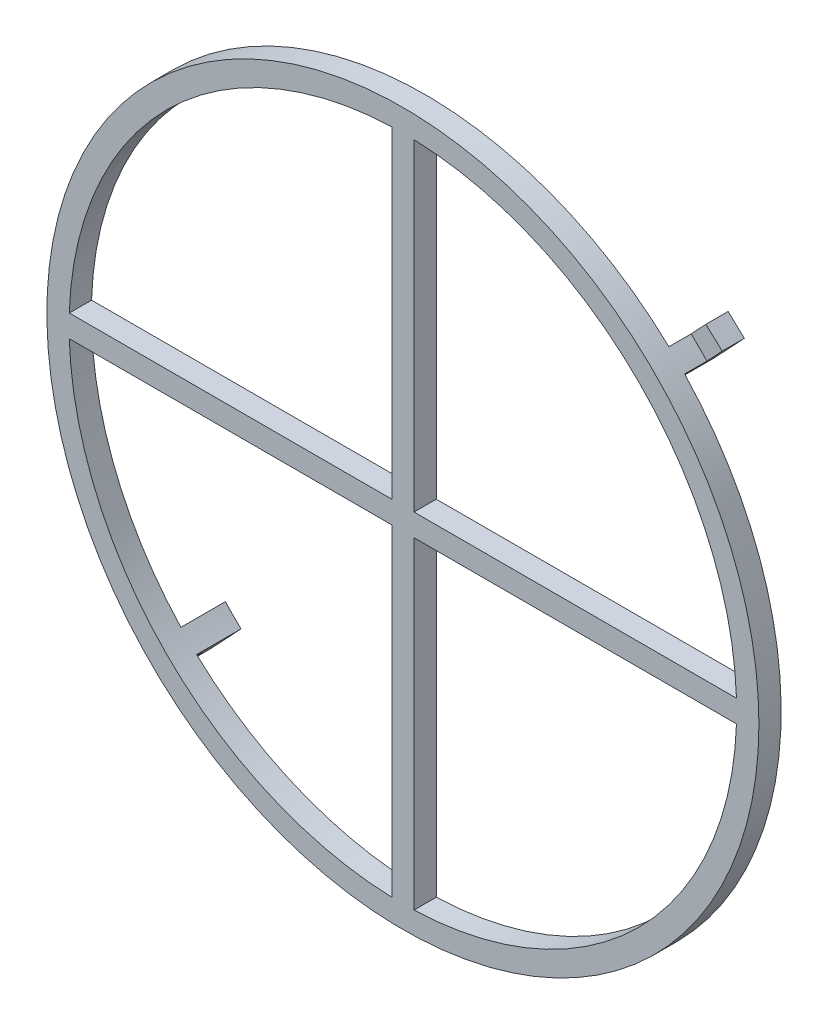
ISO-10303-21;
HEADER;
FILE_DESCRIPTION(('STEP AP214'),'2;1');
FILE_NAME('part.step','',(''),(''),'','','');
FILE_SCHEMA(('AUTOMOTIVE_DESIGN { 1 0 10303 214 1 1 1 1 }'));
ENDSEC;
DATA;
#1=APPLICATION_CONTEXT('core data for automotive mechanical design processes');
#2=APPLICATION_PROTOCOL_DEFINITION('international standard','automotive_design',2000,#1);
#3=PRODUCT_CONTEXT('',#1,'mechanical');
#4=PRODUCT('Part','Part','',(#3));
#5=PRODUCT_RELATED_PRODUCT_CATEGORY('part','',(#4));
#6=PRODUCT_DEFINITION_FORMATION('','',#4);
#7=PRODUCT_DEFINITION_CONTEXT('part definition',#1,'design');
#8=PRODUCT_DEFINITION('design','',#6,#7);
#9=PRODUCT_DEFINITION_SHAPE('','',#8);
#10=(LENGTH_UNIT() NAMED_UNIT(*) SI_UNIT(.MILLI.,.METRE.));
#11=(NAMED_UNIT(*) PLANE_ANGLE_UNIT() SI_UNIT($,.RADIAN.));
#12=(NAMED_UNIT(*) SI_UNIT($,.STERADIAN.) SOLID_ANGLE_UNIT());
#13=UNCERTAINTY_MEASURE_WITH_UNIT(LENGTH_MEASURE(1.E-05),#10,'distance_accuracy_value','');
#14=(GEOMETRIC_REPRESENTATION_CONTEXT(3) GLOBAL_UNCERTAINTY_ASSIGNED_CONTEXT((#13)) GLOBAL_UNIT_ASSIGNED_CONTEXT((#10,
#11,#12)) REPRESENTATION_CONTEXT('',''));
#15=CARTESIAN_POINT('',(0.,0.,0.));
#16=DIRECTION('',(0.,0.,1.));
#17=DIRECTION('',(1.,0.,0.));
#18=AXIS2_PLACEMENT_3D('',#15,#16,#17);
#19=CARTESIAN_POINT('',(0.,0.,0.));
#20=DIRECTION('',(0.,0.,1.));
#21=DIRECTION('',(1.,0.,0.));
#22=AXIS2_PLACEMENT_3D('',#19,#20,#21);
#23=PLANE('',#22);
#24=CARTESIAN_POINT('',(0.,0.,0.));
#25=DIRECTION('',(0.,0.,1.));
#26=DIRECTION('',(1.,0.,0.));
#27=AXIS2_PLACEMENT_3D('',#24,#25,#26);
#28=CIRCLE('',#27,15.);
#29=CARTESIAN_POINT('',(-0.499999999999996,14.9916643505649,0.));
#30=VERTEX_POINT('',#29);
#31=CARTESIAN_POINT('',(-14.9916643505649,0.499999999999996,0.));
#32=VERTEX_POINT('',#31);
#33=EDGE_CURVE('E365',#30,#32,#28,.T.);
#34=ORIENTED_EDGE('',*,*,#33,.T.);
#35=DIRECTION('',(1.,0.,0.));
#36=VECTOR('',#35,1.);
#37=CARTESIAN_POINT('',(-14.9916643505649,0.499999999999996,0.));
#38=LINE('',#37,#36);
#39=CARTESIAN_POINT('',(-0.499999999999997,0.499999999999997,0.));
#40=VERTEX_POINT('',#39);
#41=EDGE_CURVE('E377',#32,#40,#38,.T.);
#42=ORIENTED_EDGE('',*,*,#41,.T.);
#43=DIRECTION('',(0.,1.,0.));
#44=VECTOR('',#43,1.);
#45=CARTESIAN_POINT('',(-0.499999999999996,14.9916643505649,0.));
#46=LINE('',#45,#44);
#47=EDGE_CURVE('E369',#40,#30,#46,.T.);
#48=ORIENTED_EDGE('',*,*,#47,.T.);
#49=EDGE_LOOP('',(#34,#42,#48));
#50=FACE_BOUND('',#49,.T.);
#51=CARTESIAN_POINT('',(0.,0.,0.));
#52=DIRECTION('',(0.,0.,1.));
#53=DIRECTION('',(1.,0.,0.));
#54=AXIS2_PLACEMENT_3D('',#51,#52,#53);
#55=CIRCLE('',#54,15.);
#56=CARTESIAN_POINT('',(0.500000000000004,-14.9916643505649,0.));
#57=VERTEX_POINT('',#56);
#58=CARTESIAN_POINT('',(14.9916643505649,-0.500000000000003,0.));
#59=VERTEX_POINT('',#58);
#60=EDGE_CURVE('E293',#57,#59,#55,.T.);
#61=ORIENTED_EDGE('',*,*,#60,.T.);
#62=DIRECTION('',(-1.,0.,0.));
#63=VECTOR('',#62,1.);
#64=CARTESIAN_POINT('',(0.500000000000004,-0.500000000000004,0.));
#65=LINE('',#64,#63);
#66=CARTESIAN_POINT('',(0.500000000000004,-0.500000000000004,0.));
#67=VERTEX_POINT('',#66);
#68=EDGE_CURVE('E305',#59,#67,#65,.T.);
#69=ORIENTED_EDGE('',*,*,#68,.T.);
#70=DIRECTION('',(0.,-1.,0.));
#71=VECTOR('',#70,1.);
#72=CARTESIAN_POINT('',(0.500000000000004,-0.500000000000004,0.));
#73=LINE('',#72,#71);
#74=EDGE_CURVE('E297',#67,#57,#73,.T.);
#75=ORIENTED_EDGE('',*,*,#74,.T.);
#76=EDGE_LOOP('',(#61,#69,#75));
#77=FACE_BOUND('',#76,.T.);
#78=DIRECTION('',(0.684666621748958,0.728856376155735,0.));
#79=VECTOR('',#78,1.);
#80=CARTESIAN_POINT('',(-11.6617705183814,-10.9545930265168,0.));
#81=LINE('',#80,#79);
#82=CARTESIAN_POINT('',(-11.6617705183814,-10.9545930265168,0.));
#83=VERTEX_POINT('',#82);
#84=CARTESIAN_POINT('',(-10.9756744302996,-10.2242149234094,0.));
#85=VERTEX_POINT('',#84);
#86=EDGE_CURVE('E58',#83,#85,#81,.T.);
#87=ORIENTED_EDGE('',*,*,#86,.F.);
#88=CARTESIAN_POINT('',(0.,0.,0.));
#89=DIRECTION('',(0.,0.,1.));
#90=DIRECTION('',(1.,0.,0.));
#91=AXIS2_PLACEMENT_3D('',#88,#89,#90);
#92=CIRCLE('',#91,16.);
#93=CARTESIAN_POINT('',(10.9546659479833,11.6617020184918,0.));
#94=VERTEX_POINT('',#93);
#95=EDGE_CURVE('E40',#94,#83,#92,.T.);
#96=ORIENTED_EDGE('',*,*,#95,.F.);
#97=DIRECTION('',(0.684666621748957,0.728856376155735,0.));
#98=VECTOR('',#97,1.);
#99=CARTESIAN_POINT('',(10.9546659479833,11.6617020184918,0.));
#100=LINE('',#99,#98);
#101=CARTESIAN_POINT('',(10.2699993262344,10.932845642336,0.));
#102=VERTEX_POINT('',#101);
#103=EDGE_CURVE('E277',#102,#94,#100,.T.);
#104=ORIENTED_EDGE('',*,*,#103,.F.);
#105=CARTESIAN_POINT('',(0.,0.,0.));
#106=DIRECTION('',(0.,0.,1.));
#107=DIRECTION('',(1.,0.,0.));
#108=AXIS2_PLACEMENT_3D('',#105,#106,#107);
#109=CIRCLE('',#108,15.);
#110=CARTESIAN_POINT('',(0.500000000000004,14.9916643505649,0.));
#111=VERTEX_POINT('',#110);
#112=EDGE_CURVE('E317',#102,#111,#109,.T.);
#113=ORIENTED_EDGE('',*,*,#112,.T.);
#114=DIRECTION('',(0.,-1.,0.));
#115=VECTOR('',#114,1.);
#116=CARTESIAN_POINT('',(0.500000000000004,14.9916643505649,0.));
#117=LINE('',#116,#115);
#118=CARTESIAN_POINT('',(0.500000000000004,0.499999999999997,0.));
#119=VERTEX_POINT('',#118);
#120=EDGE_CURVE('E329',#111,#119,#117,.T.);
#121=ORIENTED_EDGE('',*,*,#120,.T.);
#122=DIRECTION('',(1.,0.,0.));
#123=VECTOR('',#122,1.);
#124=CARTESIAN_POINT('',(0.500000000000004,0.499999999999997,0.));
#125=LINE('',#124,#123);
#126=CARTESIAN_POINT('',(14.9916643505649,0.499999999999996,0.));
#127=VERTEX_POINT('',#126);
#128=EDGE_CURVE('E321',#119,#127,#125,.T.);
#129=ORIENTED_EDGE('',*,*,#128,.T.);
#130=CARTESIAN_POINT('',(10.9756744302996,10.2242149234094,0.));
#131=VERTEX_POINT('',#130);
#132=EDGE_CURVE('E327',#127,#131,#109,.T.);
#133=ORIENTED_EDGE('',*,*,#132,.T.);
#134=DIRECTION('',(-0.684666621748958,-0.728856376155735,0.));
#135=VECTOR('',#134,1.);
#136=CARTESIAN_POINT('',(11.6617705183814,10.9545930265168,0.));
#137=LINE('',#136,#135);
#138=CARTESIAN_POINT('',(11.6617705183814,10.9545930265168,0.));
#139=VERTEX_POINT('',#138);
#140=EDGE_CURVE('E272',#139,#131,#137,.T.);
#141=ORIENTED_EDGE('',*,*,#140,.F.);
#142=CARTESIAN_POINT('',(-10.9546659479833,-11.6617020184918,0.));
#143=VERTEX_POINT('',#142);
#144=EDGE_CURVE('E51',#143,#139,#92,.T.);
#145=ORIENTED_EDGE('',*,*,#144,.F.);
#146=DIRECTION('',(-0.684666621748957,-0.728856376155735,0.));
#147=VECTOR('',#146,1.);
#148=CARTESIAN_POINT('',(-10.9546659479833,-11.6617020184918,0.));
#149=LINE('',#148,#147);
#150=CARTESIAN_POINT('',(-10.2699993262344,-10.932845642336,0.));
#151=VERTEX_POINT('',#150);
#152=EDGE_CURVE('E241',#151,#143,#149,.T.);
#153=ORIENTED_EDGE('',*,*,#152,.F.);
#154=CARTESIAN_POINT('',(0.,0.,0.));
#155=DIRECTION('',(0.,0.,1.));
#156=DIRECTION('',(1.,0.,0.));
#157=AXIS2_PLACEMENT_3D('',#154,#155,#156);
#158=CIRCLE('',#157,15.);
#159=CARTESIAN_POINT('',(-0.499999999999996,-14.9916643505649,0.));
#160=VERTEX_POINT('',#159);
#161=EDGE_CURVE('E341',#151,#160,#158,.T.);
#162=ORIENTED_EDGE('',*,*,#161,.T.);
#163=DIRECTION('',(0.,1.,0.));
#164=VECTOR('',#163,1.);
#165=CARTESIAN_POINT('',(-0.499999999999997,-0.500000000000003,0.));
#166=LINE('',#165,#164);
#167=CARTESIAN_POINT('',(-0.499999999999997,-0.500000000000003,0.));
#168=VERTEX_POINT('',#167);
#169=EDGE_CURVE('E353',#160,#168,#166,.T.);
#170=ORIENTED_EDGE('',*,*,#169,.T.);
#171=DIRECTION('',(-1.,0.,0.));
#172=VECTOR('',#171,1.);
#173=CARTESIAN_POINT('',(-14.9916643505649,-0.500000000000003,0.));
#174=LINE('',#173,#172);
#175=CARTESIAN_POINT('',(-14.9916643505649,-0.500000000000003,0.));
#176=VERTEX_POINT('',#175);
#177=EDGE_CURVE('E345',#168,#176,#174,.T.);
#178=ORIENTED_EDGE('',*,*,#177,.T.);
#179=EDGE_CURVE('E351',#176,#85,#158,.T.);
#180=ORIENTED_EDGE('',*,*,#179,.T.);
#181=EDGE_LOOP('',(#87,#96,#104,#113,#121,#129,#133,#141,#145,#153,#162,#170,#178,#180));
#182=FACE_BOUND('',#181,.T.);
#183=ADVANCED_FACE('F36',(#50,#77,#182),#23,.F.);
#184=CARTESIAN_POINT('',(0.,0.,1.));
#185=DIRECTION('',(0.,0.,1.));
#186=DIRECTION('',(1.,0.,0.));
#187=AXIS2_PLACEMENT_3D('',#184,#185,#186);
#188=PLANE('',#187);
#189=CARTESIAN_POINT('',(0.,0.,1.));
#190=DIRECTION('',(0.,0.,1.));
#191=DIRECTION('',(1.,0.,0.));
#192=AXIS2_PLACEMENT_3D('',#189,#190,#191);
#193=CIRCLE('',#192,16.);
#194=CARTESIAN_POINT('',(16.,0.,1.));
#195=VERTEX_POINT('',#194);
#196=EDGE_CURVE('E11',#195,#195,#193,.T.);
#197=ORIENTED_EDGE('',*,*,#196,.T.);
#198=EDGE_LOOP('',(#197));
#199=FACE_BOUND('',#198,.T.);
#200=DIRECTION('',(1.,0.,0.));
#201=VECTOR('',#200,1.);
#202=CARTESIAN_POINT('',(-14.9916643505649,0.499999999999996,1.));
#203=LINE('',#202,#201);
#204=CARTESIAN_POINT('',(-14.9916643505649,0.499999999999996,1.));
#205=VERTEX_POINT('',#204);
#206=CARTESIAN_POINT('',(-0.499999999999997,0.499999999999997,1.));
#207=VERTEX_POINT('',#206);
#208=EDGE_CURVE('E368',#205,#207,#203,.T.);
#209=ORIENTED_EDGE('',*,*,#208,.F.);
#210=CARTESIAN_POINT('',(0.,0.,1.));
#211=DIRECTION('',(0.,0.,1.));
#212=DIRECTION('',(1.,0.,0.));
#213=AXIS2_PLACEMENT_3D('',#210,#211,#212);
#214=CIRCLE('',#213,15.);
#215=CARTESIAN_POINT('',(-0.499999999999996,14.9916643505649,1.));
#216=VERTEX_POINT('',#215);
#217=EDGE_CURVE('E366',#216,#205,#214,.T.);
#218=ORIENTED_EDGE('',*,*,#217,.F.);
#219=DIRECTION('',(0.,1.,0.));
#220=VECTOR('',#219,1.);
#221=CARTESIAN_POINT('',(-0.499999999999996,14.9916643505649,1.));
#222=LINE('',#221,#220);
#223=EDGE_CURVE('E372',#207,#216,#222,.T.);
#224=ORIENTED_EDGE('',*,*,#223,.F.);
#225=EDGE_LOOP('',(#209,#218,#224));
#226=FACE_BOUND('',#225,.T.);
#227=DIRECTION('',(0.,1.,0.));
#228=VECTOR('',#227,1.);
#229=CARTESIAN_POINT('',(-0.499999999999997,-0.500000000000003,1.));
#230=LINE('',#229,#228);
#231=CARTESIAN_POINT('',(-0.499999999999996,-14.9916643505649,1.));
#232=VERTEX_POINT('',#231);
#233=CARTESIAN_POINT('',(-0.499999999999997,-0.500000000000003,1.));
#234=VERTEX_POINT('',#233);
#235=EDGE_CURVE('E344',#232,#234,#230,.T.);
#236=ORIENTED_EDGE('',*,*,#235,.F.);
#237=CARTESIAN_POINT('',(0.,0.,1.));
#238=DIRECTION('',(0.,0.,1.));
#239=DIRECTION('',(1.,0.,0.));
#240=AXIS2_PLACEMENT_3D('',#237,#238,#239);
#241=CIRCLE('',#240,15.);
#242=CARTESIAN_POINT('',(-14.9916643505649,-0.500000000000003,1.));
#243=VERTEX_POINT('',#242);
#244=EDGE_CURVE('E342',#243,#232,#241,.T.);
#245=ORIENTED_EDGE('',*,*,#244,.F.);
#246=DIRECTION('',(-1.,0.,0.));
#247=VECTOR('',#246,1.);
#248=CARTESIAN_POINT('',(-14.9916643505649,-0.500000000000003,1.));
#249=LINE('',#248,#247);
#250=EDGE_CURVE('E348',#234,#243,#249,.T.);
#251=ORIENTED_EDGE('',*,*,#250,.F.);
#252=EDGE_LOOP('',(#236,#245,#251));
#253=FACE_BOUND('',#252,.T.);
#254=DIRECTION('',(0.,-1.,0.));
#255=VECTOR('',#254,1.);
#256=CARTESIAN_POINT('',(0.500000000000004,14.9916643505649,1.));
#257=LINE('',#256,#255);
#258=CARTESIAN_POINT('',(0.500000000000004,14.9916643505649,1.));
#259=VERTEX_POINT('',#258);
#260=CARTESIAN_POINT('',(0.500000000000004,0.499999999999997,1.));
#261=VERTEX_POINT('',#260);
#262=EDGE_CURVE('E320',#259,#261,#257,.T.);
#263=ORIENTED_EDGE('',*,*,#262,.F.);
#264=CARTESIAN_POINT('',(0.,0.,1.));
#265=DIRECTION('',(0.,0.,1.));
#266=DIRECTION('',(1.,0.,0.));
#267=AXIS2_PLACEMENT_3D('',#264,#265,#266);
#268=CIRCLE('',#267,15.);
#269=CARTESIAN_POINT('',(14.9916643505649,0.499999999999996,1.));
#270=VERTEX_POINT('',#269);
#271=EDGE_CURVE('E318',#270,#259,#268,.T.);
#272=ORIENTED_EDGE('',*,*,#271,.F.);
#273=DIRECTION('',(1.,0.,0.));
#274=VECTOR('',#273,1.);
#275=CARTESIAN_POINT('',(0.500000000000004,0.499999999999997,1.));
#276=LINE('',#275,#274);
#277=EDGE_CURVE('E324',#261,#270,#276,.T.);
#278=ORIENTED_EDGE('',*,*,#277,.F.);
#279=EDGE_LOOP('',(#263,#272,#278));
#280=FACE_BOUND('',#279,.T.);
#281=DIRECTION('',(-1.,0.,0.));
#282=VECTOR('',#281,1.);
#283=CARTESIAN_POINT('',(0.500000000000004,-0.500000000000004,1.));
#284=LINE('',#283,#282);
#285=CARTESIAN_POINT('',(14.9916643505649,-0.500000000000003,1.));
#286=VERTEX_POINT('',#285);
#287=CARTESIAN_POINT('',(0.500000000000004,-0.500000000000004,1.));
#288=VERTEX_POINT('',#287);
#289=EDGE_CURVE('E296',#286,#288,#284,.T.);
#290=ORIENTED_EDGE('',*,*,#289,.F.);
#291=CARTESIAN_POINT('',(0.,0.,1.));
#292=DIRECTION('',(0.,0.,1.));
#293=DIRECTION('',(1.,0.,0.));
#294=AXIS2_PLACEMENT_3D('',#291,#292,#293);
#295=CIRCLE('',#294,15.);
#296=CARTESIAN_POINT('',(0.500000000000004,-14.9916643505649,1.));
#297=VERTEX_POINT('',#296);
#298=EDGE_CURVE('E294',#297,#286,#295,.T.);
#299=ORIENTED_EDGE('',*,*,#298,.F.);
#300=DIRECTION('',(0.,-1.,0.));
#301=VECTOR('',#300,1.);
#302=CARTESIAN_POINT('',(0.500000000000004,-0.500000000000004,1.));
#303=LINE('',#302,#301);
#304=EDGE_CURVE('E300',#288,#297,#303,.T.);
#305=ORIENTED_EDGE('',*,*,#304,.F.);
#306=EDGE_LOOP('',(#290,#299,#305));
#307=FACE_BOUND('',#306,.T.);
#308=ADVANCED_FACE('F412',(#199,#226,#253,#280,#307),#188,.T.);
#309=CARTESIAN_POINT('',(0.,0.,1.));
#310=DIRECTION('',(0.,0.,-1.));
#311=DIRECTION('',(-1.,0.,0.));
#312=AXIS2_PLACEMENT_3D('',#309,#310,#311);
#313=CYLINDRICAL_SURFACE('',#312,16.);
#314=ORIENTED_EDGE('',*,*,#196,.F.);
#315=EDGE_LOOP('',(#314));
#316=FACE_BOUND('',#315,.T.);
#317=ORIENTED_EDGE('',*,*,#95,.T.);
#318=DIRECTION('',(0.,0.,1.));
#319=VECTOR('',#318,1.);
#320=CARTESIAN_POINT('',(-11.6617705183814,-10.9545930265168,-1.));
#321=LINE('',#320,#319);
#322=CARTESIAN_POINT('',(-11.6617705183814,-10.9545930265168,-1.));
#323=VERTEX_POINT('',#322);
#324=EDGE_CURVE('E205',#323,#83,#321,.T.);
#325=ORIENTED_EDGE('',*,*,#324,.F.);
#326=CARTESIAN_POINT('',(0.,0.,-1.));
#327=DIRECTION('',(0.,0.,-1.));
#328=DIRECTION('',(1.,0.,0.));
#329=AXIS2_PLACEMENT_3D('',#326,#327,#328);
#330=CIRCLE('',#329,16.);
#331=CARTESIAN_POINT('',(-10.9546659479833,-11.6617020184918,-1.));
#332=VERTEX_POINT('',#331);
#333=EDGE_CURVE('E237',#332,#323,#330,.T.);
#334=ORIENTED_EDGE('',*,*,#333,.F.);
#335=DIRECTION('',(0.,0.,1.));
#336=VECTOR('',#335,1.);
#337=CARTESIAN_POINT('',(-10.9546659479833,-11.6617020184918,-1.));
#338=LINE('',#337,#336);
#339=EDGE_CURVE('E240',#332,#143,#338,.T.);
#340=ORIENTED_EDGE('',*,*,#339,.T.);
#341=ORIENTED_EDGE('',*,*,#144,.T.);
#342=DIRECTION('',(0.,0.,1.));
#343=VECTOR('',#342,1.);
#344=CARTESIAN_POINT('',(11.6617705183814,10.9545930265168,-1.));
#345=LINE('',#344,#343);
#346=CARTESIAN_POINT('',(11.6617705183814,10.9545930265168,-1.));
#347=VERTEX_POINT('',#346);
#348=EDGE_CURVE('E290',#347,#139,#345,.T.);
#349=ORIENTED_EDGE('',*,*,#348,.F.);
#350=CARTESIAN_POINT('',(0.,0.,-1.));
#351=DIRECTION('',(0.,0.,-1.));
#352=DIRECTION('',(-1.,0.,0.));
#353=AXIS2_PLACEMENT_3D('',#350,#351,#352);
#354=CIRCLE('',#353,16.);
#355=CARTESIAN_POINT('',(10.9546659479833,11.6617020184918,-1.));
#356=VERTEX_POINT('',#355);
#357=EDGE_CURVE('E273',#356,#347,#354,.T.);
#358=ORIENTED_EDGE('',*,*,#357,.F.);
#359=DIRECTION('',(0.,0.,1.));
#360=VECTOR('',#359,1.);
#361=CARTESIAN_POINT('',(10.9546659479833,11.6617020184918,-1.));
#362=LINE('',#361,#360);
#363=EDGE_CURVE('E276',#356,#94,#362,.T.);
#364=ORIENTED_EDGE('',*,*,#363,.T.);
#365=EDGE_LOOP('',(#317,#325,#334,#340,#341,#349,#358,#364));
#366=FACE_BOUND('',#365,.T.);
#367=ADVANCED_FACE('F38',(#316,#366),#313,.T.);
#368=CARTESIAN_POINT('',(0.,0.,1.));
#369=DIRECTION('',(0.,0.,-1.));
#370=DIRECTION('',(-1.,0.,0.));
#371=AXIS2_PLACEMENT_3D('',#368,#369,#370);
#372=CYLINDRICAL_SURFACE('',#371,15.);
#373=ORIENTED_EDGE('',*,*,#33,.F.);
#374=DIRECTION('',(0.,0.,-1.));
#375=VECTOR('',#374,1.);
#376=CARTESIAN_POINT('',(-0.499999999999996,14.9916643505649,1.));
#377=LINE('',#376,#375);
#378=EDGE_CURVE('E374',#216,#30,#377,.T.);
#379=ORIENTED_EDGE('',*,*,#378,.F.);
#380=ORIENTED_EDGE('',*,*,#217,.T.);
#381=DIRECTION('',(0.,0.,-1.));
#382=VECTOR('',#381,1.);
#383=CARTESIAN_POINT('',(-14.9916643505649,0.499999999999996,1.));
#384=LINE('',#383,#382);
#385=EDGE_CURVE('E386',#205,#32,#384,.T.);
#386=ORIENTED_EDGE('',*,*,#385,.T.);
#387=EDGE_LOOP('',(#373,#379,#380,#386));
#388=FACE_BOUND('',#387,.T.);
#389=ADVANCED_FACE('F436',(#388),#372,.F.);
#390=CARTESIAN_POINT('',(-14.9916643505649,0.499999999999996,1.));
#391=DIRECTION('',(0.,1.,0.));
#392=DIRECTION('',(-1.,0.,0.));
#393=AXIS2_PLACEMENT_3D('',#390,#391,#392);
#394=PLANE('',#393);
#395=ORIENTED_EDGE('',*,*,#41,.F.);
#396=ORIENTED_EDGE('',*,*,#385,.F.);
#397=ORIENTED_EDGE('',*,*,#208,.T.);
#398=DIRECTION('',(0.,0.,-1.));
#399=VECTOR('',#398,1.);
#400=CARTESIAN_POINT('',(-0.499999999999997,0.499999999999997,1.));
#401=LINE('',#400,#399);
#402=EDGE_CURVE('E384',#207,#40,#401,.T.);
#403=ORIENTED_EDGE('',*,*,#402,.T.);
#404=EDGE_LOOP('',(#395,#396,#397,#403));
#405=FACE_BOUND('',#404,.T.);
#406=ADVANCED_FACE('F439',(#405),#394,.T.);
#407=CARTESIAN_POINT('',(-0.499999999999996,14.9916643505649,1.));
#408=DIRECTION('',(-1.,0.,0.));
#409=DIRECTION('',(0.,-1.,0.));
#410=AXIS2_PLACEMENT_3D('',#407,#408,#409);
#411=PLANE('',#410);
#412=ORIENTED_EDGE('',*,*,#47,.F.);
#413=ORIENTED_EDGE('',*,*,#402,.F.);
#414=ORIENTED_EDGE('',*,*,#223,.T.);
#415=ORIENTED_EDGE('',*,*,#378,.T.);
#416=EDGE_LOOP('',(#412,#413,#414,#415));
#417=FACE_BOUND('',#416,.T.);
#418=ADVANCED_FACE('F442',(#417),#411,.T.);
#419=CARTESIAN_POINT('',(0.,0.,1.));
#420=DIRECTION('',(0.,0.,-1.));
#421=DIRECTION('',(-1.,0.,0.));
#422=AXIS2_PLACEMENT_3D('',#419,#420,#421);
#423=CYLINDRICAL_SURFACE('',#422,15.);
#424=ORIENTED_EDGE('',*,*,#179,.F.);
#425=DIRECTION('',(0.,0.,-1.));
#426=VECTOR('',#425,1.);
#427=CARTESIAN_POINT('',(-14.9916643505649,-0.500000000000003,1.));
#428=LINE('',#427,#426);
#429=EDGE_CURVE('E350',#243,#176,#428,.T.);
#430=ORIENTED_EDGE('',*,*,#429,.F.);
#431=ORIENTED_EDGE('',*,*,#244,.T.);
#432=DIRECTION('',(0.,0.,-1.));
#433=VECTOR('',#432,1.);
#434=CARTESIAN_POINT('',(-0.499999999999996,-14.9916643505649,1.));
#435=LINE('',#434,#433);
#436=EDGE_CURVE('E362',#232,#160,#435,.T.);
#437=ORIENTED_EDGE('',*,*,#436,.T.);
#438=ORIENTED_EDGE('',*,*,#161,.F.);
#439=DIRECTION('',(0.,0.,1.));
#440=VECTOR('',#439,1.);
#441=CARTESIAN_POINT('',(-10.2699993262344,-10.932845642336,-1.));
#442=LINE('',#441,#440);
#443=CARTESIAN_POINT('',(-10.2699993262344,-10.932845642336,-2.));
#444=VERTEX_POINT('',#443);
#445=EDGE_CURVE('E206',#444,#151,#442,.T.);
#446=ORIENTED_EDGE('',*,*,#445,.F.);
#447=CARTESIAN_POINT('',(0.,0.,-2.));
#448=DIRECTION('',(0.,0.,1.));
#449=DIRECTION('',(1.,0.,0.));
#450=AXIS2_PLACEMENT_3D('',#447,#448,#449);
#451=CIRCLE('',#450,15.);
#452=CARTESIAN_POINT('',(-10.9756744302996,-10.2242149234094,-2.));
#453=VERTEX_POINT('',#452);
#454=EDGE_CURVE('E211',#453,#444,#451,.T.);
#455=ORIENTED_EDGE('',*,*,#454,.F.);
#456=DIRECTION('',(0.,0.,1.));
#457=VECTOR('',#456,1.);
#458=CARTESIAN_POINT('',(-10.9756744302996,-10.2242149234094,-1.));
#459=LINE('',#458,#457);
#460=EDGE_CURVE('E197',#453,#85,#459,.T.);
#461=ORIENTED_EDGE('',*,*,#460,.T.);
#462=EDGE_LOOP('',(#424,#430,#431,#437,#438,#446,#455,#461));
#463=FACE_BOUND('',#462,.T.);
#464=ADVANCED_FACE('F218',(#463),#423,.F.);
#465=CARTESIAN_POINT('',(-0.499999999999997,-0.500000000000003,1.));
#466=DIRECTION('',(-1.,0.,0.));
#467=DIRECTION('',(0.,-1.,0.));
#468=AXIS2_PLACEMENT_3D('',#465,#466,#467);
#469=PLANE('',#468);
#470=ORIENTED_EDGE('',*,*,#169,.F.);
#471=ORIENTED_EDGE('',*,*,#436,.F.);
#472=ORIENTED_EDGE('',*,*,#235,.T.);
#473=DIRECTION('',(0.,0.,-1.));
#474=VECTOR('',#473,1.);
#475=CARTESIAN_POINT('',(-0.499999999999997,-0.500000000000003,1.));
#476=LINE('',#475,#474);
#477=EDGE_CURVE('E360',#234,#168,#476,.T.);
#478=ORIENTED_EDGE('',*,*,#477,.T.);
#479=EDGE_LOOP('',(#470,#471,#472,#478));
#480=FACE_BOUND('',#479,.T.);
#481=ADVANCED_FACE('F405',(#480),#469,.T.);
#482=CARTESIAN_POINT('',(-14.9916643505649,-0.500000000000003,1.));
#483=DIRECTION('',(0.,-1.,0.));
#484=DIRECTION('',(0.,0.,-1.));
#485=AXIS2_PLACEMENT_3D('',#482,#483,#484);
#486=PLANE('',#485);
#487=ORIENTED_EDGE('',*,*,#177,.F.);
#488=ORIENTED_EDGE('',*,*,#477,.F.);
#489=ORIENTED_EDGE('',*,*,#250,.T.);
#490=ORIENTED_EDGE('',*,*,#429,.T.);
#491=EDGE_LOOP('',(#487,#488,#489,#490));
#492=FACE_BOUND('',#491,.T.);
#493=ADVANCED_FACE('F415',(#492),#486,.T.);
#494=CARTESIAN_POINT('',(0.,0.,1.));
#495=DIRECTION('',(0.,0.,-1.));
#496=DIRECTION('',(-1.,0.,0.));
#497=AXIS2_PLACEMENT_3D('',#494,#495,#496);
#498=CYLINDRICAL_SURFACE('',#497,15.);
#499=ORIENTED_EDGE('',*,*,#132,.F.);
#500=DIRECTION('',(0.,0.,-1.));
#501=VECTOR('',#500,1.);
#502=CARTESIAN_POINT('',(14.9916643505649,0.499999999999996,1.));
#503=LINE('',#502,#501);
#504=EDGE_CURVE('E326',#270,#127,#503,.T.);
#505=ORIENTED_EDGE('',*,*,#504,.F.);
#506=ORIENTED_EDGE('',*,*,#271,.T.);
#507=DIRECTION('',(0.,0.,-1.));
#508=VECTOR('',#507,1.);
#509=CARTESIAN_POINT('',(0.500000000000004,14.9916643505649,1.));
#510=LINE('',#509,#508);
#511=EDGE_CURVE('E338',#259,#111,#510,.T.);
#512=ORIENTED_EDGE('',*,*,#511,.T.);
#513=ORIENTED_EDGE('',*,*,#112,.F.);
#514=DIRECTION('',(0.,0.,1.));
#515=VECTOR('',#514,1.);
#516=CARTESIAN_POINT('',(10.2699993262344,10.932845642336,-1.));
#517=LINE('',#516,#515);
#518=CARTESIAN_POINT('',(10.2699993262344,10.932845642336,-2.));
#519=VERTEX_POINT('',#518);
#520=EDGE_CURVE('E284',#519,#102,#517,.T.);
#521=ORIENTED_EDGE('',*,*,#520,.F.);
#522=CARTESIAN_POINT('',(0.,0.,-2.));
#523=DIRECTION('',(0.,0.,1.));
#524=DIRECTION('',(-1.,0.,0.));
#525=AXIS2_PLACEMENT_3D('',#522,#523,#524);
#526=CIRCLE('',#525,15.);
#527=CARTESIAN_POINT('',(10.9756744302996,10.2242149234094,-2.));
#528=VERTEX_POINT('',#527);
#529=EDGE_CURVE('E252',#528,#519,#526,.T.);
#530=ORIENTED_EDGE('',*,*,#529,.F.);
#531=DIRECTION('',(0.,0.,1.));
#532=VECTOR('',#531,1.);
#533=CARTESIAN_POINT('',(10.9756744302996,10.2242149234094,-1.));
#534=LINE('',#533,#532);
#535=EDGE_CURVE('E287',#528,#131,#534,.T.);
#536=ORIENTED_EDGE('',*,*,#535,.T.);
#537=EDGE_LOOP('',(#499,#505,#506,#512,#513,#521,#530,#536));
#538=FACE_BOUND('',#537,.T.);
#539=ADVANCED_FACE('F417',(#538),#498,.F.);
#540=CARTESIAN_POINT('',(0.500000000000004,14.9916643505649,1.));
#541=DIRECTION('',(1.,0.,0.));
#542=DIRECTION('',(0.,1.,0.));
#543=AXIS2_PLACEMENT_3D('',#540,#541,#542);
#544=PLANE('',#543);
#545=ORIENTED_EDGE('',*,*,#120,.F.);
#546=ORIENTED_EDGE('',*,*,#511,.F.);
#547=ORIENTED_EDGE('',*,*,#262,.T.);
#548=DIRECTION('',(0.,0.,-1.));
#549=VECTOR('',#548,1.);
#550=CARTESIAN_POINT('',(0.500000000000004,0.499999999999997,1.));
#551=LINE('',#550,#549);
#552=EDGE_CURVE('E336',#261,#119,#551,.T.);
#553=ORIENTED_EDGE('',*,*,#552,.T.);
#554=EDGE_LOOP('',(#545,#546,#547,#553));
#555=FACE_BOUND('',#554,.T.);
#556=ADVANCED_FACE('F423',(#555),#544,.T.);
#557=CARTESIAN_POINT('',(0.500000000000004,0.499999999999997,1.));
#558=DIRECTION('',(0.,1.,0.));
#559=DIRECTION('',(-1.,0.,0.));
#560=AXIS2_PLACEMENT_3D('',#557,#558,#559);
#561=PLANE('',#560);
#562=ORIENTED_EDGE('',*,*,#128,.F.);
#563=ORIENTED_EDGE('',*,*,#552,.F.);
#564=ORIENTED_EDGE('',*,*,#277,.T.);
#565=ORIENTED_EDGE('',*,*,#504,.T.);
#566=EDGE_LOOP('',(#562,#563,#564,#565));
#567=FACE_BOUND('',#566,.T.);
#568=ADVANCED_FACE('F476',(#567),#561,.T.);
#569=CARTESIAN_POINT('',(0.,0.,1.));
#570=DIRECTION('',(0.,0.,-1.));
#571=DIRECTION('',(-1.,0.,0.));
#572=AXIS2_PLACEMENT_3D('',#569,#570,#571);
#573=CYLINDRICAL_SURFACE('',#572,15.);
#574=ORIENTED_EDGE('',*,*,#60,.F.);
#575=DIRECTION('',(0.,0.,-1.));
#576=VECTOR('',#575,1.);
#577=CARTESIAN_POINT('',(0.500000000000004,-14.9916643505649,1.));
#578=LINE('',#577,#576);
#579=EDGE_CURVE('E302',#297,#57,#578,.T.);
#580=ORIENTED_EDGE('',*,*,#579,.F.);
#581=ORIENTED_EDGE('',*,*,#298,.T.);
#582=DIRECTION('',(0.,0.,-1.));
#583=VECTOR('',#582,1.);
#584=CARTESIAN_POINT('',(14.9916643505649,-0.500000000000003,1.));
#585=LINE('',#584,#583);
#586=EDGE_CURVE('E314',#286,#59,#585,.T.);
#587=ORIENTED_EDGE('',*,*,#586,.T.);
#588=EDGE_LOOP('',(#574,#580,#581,#587));
#589=FACE_BOUND('',#588,.T.);
#590=ADVANCED_FACE('F486',(#589),#573,.F.);
#591=CARTESIAN_POINT('',(0.500000000000004,-0.500000000000004,1.));
#592=DIRECTION('',(0.,-1.,0.));
#593=DIRECTION('',(1.,0.,0.));
#594=AXIS2_PLACEMENT_3D('',#591,#592,#593);
#595=PLANE('',#594);
#596=ORIENTED_EDGE('',*,*,#68,.F.);
#597=ORIENTED_EDGE('',*,*,#586,.F.);
#598=ORIENTED_EDGE('',*,*,#289,.T.);
#599=DIRECTION('',(0.,0.,-1.));
#600=VECTOR('',#599,1.);
#601=CARTESIAN_POINT('',(0.500000000000004,-0.500000000000004,1.));
#602=LINE('',#601,#600);
#603=EDGE_CURVE('E312',#288,#67,#602,.T.);
#604=ORIENTED_EDGE('',*,*,#603,.T.);
#605=EDGE_LOOP('',(#596,#597,#598,#604));
#606=FACE_BOUND('',#605,.T.);
#607=ADVANCED_FACE('F496',(#606),#595,.T.);
#608=CARTESIAN_POINT('',(0.500000000000004,-0.500000000000004,1.));
#609=DIRECTION('',(1.,0.,0.));
#610=DIRECTION('',(0.,0.,-1.));
#611=AXIS2_PLACEMENT_3D('',#608,#609,#610);
#612=PLANE('',#611);
#613=ORIENTED_EDGE('',*,*,#74,.F.);
#614=ORIENTED_EDGE('',*,*,#603,.F.);
#615=ORIENTED_EDGE('',*,*,#304,.T.);
#616=ORIENTED_EDGE('',*,*,#579,.T.);
#617=EDGE_LOOP('',(#613,#614,#615,#616));
#618=FACE_BOUND('',#617,.T.);
#619=ADVANCED_FACE('F506',(#618),#612,.T.);
#620=CARTESIAN_POINT('',(11.6617705183814,10.9545930265168,-1.));
#621=DIRECTION('',(-0.728856376155735,0.684666621748958,0.));
#622=DIRECTION('',(-0.684666621748958,-0.728856376155735,0.));
#623=AXIS2_PLACEMENT_3D('',#620,#621,#622);
#624=PLANE('',#623);
#625=ORIENTED_EDGE('',*,*,#140,.T.);
#626=ORIENTED_EDGE('',*,*,#535,.F.);
#627=DIRECTION('',(-0.684666621748958,-0.728856376155735,0.));
#628=VECTOR('',#627,1.);
#629=CARTESIAN_POINT('',(11.6617705183814,10.9545930265168,-2.));
#630=LINE('',#629,#628);
#631=CARTESIAN_POINT('',(12.3464371401304,11.6834494026725,-2.));
#632=VERTEX_POINT('',#631);
#633=EDGE_CURVE('E249',#632,#528,#630,.T.);
#634=ORIENTED_EDGE('',*,*,#633,.F.);
#635=DIRECTION('',(0.,0.,1.));
#636=VECTOR('',#635,1.);
#637=CARTESIAN_POINT('',(12.3464371401304,11.6834494026725,-2.));
#638=LINE('',#637,#636);
#639=CARTESIAN_POINT('',(12.3464371401304,11.6834494026725,-1.));
#640=VERTEX_POINT('',#639);
#641=EDGE_CURVE('E260',#632,#640,#638,.T.);
#642=ORIENTED_EDGE('',*,*,#641,.T.);
#643=DIRECTION('',(-0.684666621748958,-0.728856376155735,0.));
#644=VECTOR('',#643,1.);
#645=CARTESIAN_POINT('',(11.6617705183814,10.9545930265168,-1.));
#646=LINE('',#645,#644);
#647=EDGE_CURVE('E248',#640,#347,#646,.T.);
#648=ORIENTED_EDGE('',*,*,#647,.T.);
#649=ORIENTED_EDGE('',*,*,#348,.T.);
#650=EDGE_LOOP('',(#625,#626,#634,#642,#648,#649));
#651=FACE_BOUND('',#650,.T.);
#652=ADVANCED_FACE('F516',(#651),#624,.F.);
#653=CARTESIAN_POINT('',(10.9546659479833,11.6617020184918,-1.));
#654=DIRECTION('',(0.728856376155735,-0.684666621748957,0.));
#655=DIRECTION('',(0.684666621748957,0.728856376155735,0.));
#656=AXIS2_PLACEMENT_3D('',#653,#654,#655);
#657=PLANE('',#656);
#658=ORIENTED_EDGE('',*,*,#103,.T.);
#659=ORIENTED_EDGE('',*,*,#363,.F.);
#660=DIRECTION('',(0.684666621748959,0.728856376155733,0.));
#661=VECTOR('',#660,1.);
#662=CARTESIAN_POINT('',(10.9546659479833,11.6617020184918,-1.));
#663=LINE('',#662,#661);
#664=CARTESIAN_POINT('',(11.6179367378024,12.3677816328924,-1.));
#665=VERTEX_POINT('',#664);
#666=EDGE_CURVE('E263',#356,#665,#663,.T.);
#667=ORIENTED_EDGE('',*,*,#666,.T.);
#668=DIRECTION('',(0.,0.,1.));
#669=VECTOR('',#668,1.);
#670=CARTESIAN_POINT('',(11.6179367378024,12.3677816328924,-2.));
#671=LINE('',#670,#669);
#672=CARTESIAN_POINT('',(11.6179367378024,12.3677816328924,-2.));
#673=VERTEX_POINT('',#672);
#674=EDGE_CURVE('E269',#673,#665,#671,.T.);
#675=ORIENTED_EDGE('',*,*,#674,.F.);
#676=DIRECTION('',(0.68466662174896,0.728856376155733,0.));
#677=VECTOR('',#676,1.);
#678=CARTESIAN_POINT('',(10.2699993262344,10.932845642336,-2.));
#679=LINE('',#678,#677);
#680=EDGE_CURVE('E256',#519,#673,#679,.T.);
#681=ORIENTED_EDGE('',*,*,#680,.F.);
#682=ORIENTED_EDGE('',*,*,#520,.T.);
#683=EDGE_LOOP('',(#658,#659,#667,#675,#681,#682));
#684=FACE_BOUND('',#683,.T.);
#685=ADVANCED_FACE('F536',(#684),#657,.F.);
#686=CARTESIAN_POINT('',(11.6179367378024,12.3677816328924,-2.));
#687=DIRECTION('',(-0.684666621748959,-0.728856376155734,0.));
#688=DIRECTION('',(0.728856376155734,-0.684666621748959,0.));
#689=AXIS2_PLACEMENT_3D('',#686,#687,#688);
#690=PLANE('',#689);
#691=DIRECTION('',(0.728856376155733,-0.684666621748959,0.));
#692=VECTOR('',#691,1.);
#693=CARTESIAN_POINT('',(11.6179367378024,12.3677816328924,-1.));
#694=LINE('',#693,#692);
#695=EDGE_CURVE('E253',#665,#640,#694,.T.);
#696=ORIENTED_EDGE('',*,*,#695,.T.);
#697=ORIENTED_EDGE('',*,*,#641,.F.);
#698=DIRECTION('',(0.728856376155733,-0.684666621748959,0.));
#699=VECTOR('',#698,1.);
#700=CARTESIAN_POINT('',(11.6179367378024,12.3677816328924,-2.));
#701=LINE('',#700,#699);
#702=EDGE_CURVE('E258',#673,#632,#701,.T.);
#703=ORIENTED_EDGE('',*,*,#702,.F.);
#704=ORIENTED_EDGE('',*,*,#674,.T.);
#705=EDGE_LOOP('',(#696,#697,#703,#704));
#706=FACE_BOUND('',#705,.T.);
#707=ADVANCED_FACE('F547',(#706),#690,.F.);
#708=CARTESIAN_POINT('',(0.,0.,-2.));
#709=DIRECTION('',(0.,0.,-1.));
#710=DIRECTION('',(-1.,0.,0.));
#711=AXIS2_PLACEMENT_3D('',#708,#709,#710);
#712=PLANE('',#711);
#713=ORIENTED_EDGE('',*,*,#633,.T.);
#714=ORIENTED_EDGE('',*,*,#529,.T.);
#715=ORIENTED_EDGE('',*,*,#680,.T.);
#716=ORIENTED_EDGE('',*,*,#702,.T.);
#717=EDGE_LOOP('',(#713,#714,#715,#716));
#718=FACE_BOUND('',#717,.T.);
#719=ADVANCED_FACE('F557',(#718),#712,.T.);
#720=CARTESIAN_POINT('',(0.,0.,-1.));
#721=DIRECTION('',(0.,0.,-1.));
#722=DIRECTION('',(-1.,0.,0.));
#723=AXIS2_PLACEMENT_3D('',#720,#721,#722);
#724=PLANE('',#723);
#725=ORIENTED_EDGE('',*,*,#666,.F.);
#726=ORIENTED_EDGE('',*,*,#357,.T.);
#727=ORIENTED_EDGE('',*,*,#647,.F.);
#728=ORIENTED_EDGE('',*,*,#695,.F.);
#729=EDGE_LOOP('',(#725,#726,#727,#728));
#730=FACE_BOUND('',#729,.T.);
#731=ADVANCED_FACE('F567',(#730),#724,.F.);
#732=CARTESIAN_POINT('',(-11.6617705183814,-10.9545930265168,-1.));
#733=DIRECTION('',(0.728856376155735,-0.684666621748958,0.));
#734=DIRECTION('',(0.684666621748958,0.728856376155735,0.));
#735=AXIS2_PLACEMENT_3D('',#732,#733,#734);
#736=PLANE('',#735);
#737=ORIENTED_EDGE('',*,*,#86,.T.);
#738=ORIENTED_EDGE('',*,*,#460,.F.);
#739=DIRECTION('',(0.684666621748958,0.728856376155735,0.));
#740=VECTOR('',#739,1.);
#741=CARTESIAN_POINT('',(-11.6617705183814,-10.9545930265168,-2.));
#742=LINE('',#741,#740);
#743=CARTESIAN_POINT('',(-12.3464371401304,-11.6834494026725,-2.));
#744=VERTEX_POINT('',#743);
#745=EDGE_CURVE('E201',#744,#453,#742,.T.);
#746=ORIENTED_EDGE('',*,*,#745,.F.);
#747=DIRECTION('',(0.,0.,1.));
#748=VECTOR('',#747,1.);
#749=CARTESIAN_POINT('',(-12.3464371401304,-11.6834494026725,-2.));
#750=LINE('',#749,#748);
#751=CARTESIAN_POINT('',(-12.3464371401304,-11.6834494026725,-1.));
#752=VERTEX_POINT('',#751);
#753=EDGE_CURVE('E225',#744,#752,#750,.T.);
#754=ORIENTED_EDGE('',*,*,#753,.T.);
#755=DIRECTION('',(0.684666621748958,0.728856376155735,0.));
#756=VECTOR('',#755,1.);
#757=CARTESIAN_POINT('',(-11.6617705183814,-10.9545930265168,-1.));
#758=LINE('',#757,#756);
#759=EDGE_CURVE('E226',#752,#323,#758,.T.);
#760=ORIENTED_EDGE('',*,*,#759,.T.);
#761=ORIENTED_EDGE('',*,*,#324,.T.);
#762=EDGE_LOOP('',(#737,#738,#746,#754,#760,#761));
#763=FACE_BOUND('',#762,.T.);
#764=ADVANCED_FACE('F199',(#763),#736,.F.);
#765=CARTESIAN_POINT('',(-10.9546659479833,-11.6617020184918,-1.));
#766=DIRECTION('',(-0.728856376155735,0.684666621748957,0.));
#767=DIRECTION('',(-0.684666621748957,-0.728856376155735,0.));
#768=AXIS2_PLACEMENT_3D('',#765,#766,#767);
#769=PLANE('',#768);
#770=ORIENTED_EDGE('',*,*,#152,.T.);
#771=ORIENTED_EDGE('',*,*,#339,.F.);
#772=DIRECTION('',(-0.684666621748959,-0.728856376155733,0.));
#773=VECTOR('',#772,1.);
#774=CARTESIAN_POINT('',(-10.9546659479833,-11.6617020184918,-1.));
#775=LINE('',#774,#773);
#776=CARTESIAN_POINT('',(-11.6179367378024,-12.3677816328924,-1.));
#777=VERTEX_POINT('',#776);
#778=EDGE_CURVE('E229',#332,#777,#775,.T.);
#779=ORIENTED_EDGE('',*,*,#778,.T.);
#780=DIRECTION('',(0.,0.,1.));
#781=VECTOR('',#780,1.);
#782=CARTESIAN_POINT('',(-11.6179367378024,-12.3677816328924,-2.));
#783=LINE('',#782,#781);
#784=CARTESIAN_POINT('',(-11.6179367378024,-12.3677816328924,-2.));
#785=VERTEX_POINT('',#784);
#786=EDGE_CURVE('E234',#785,#777,#783,.T.);
#787=ORIENTED_EDGE('',*,*,#786,.F.);
#788=DIRECTION('',(-0.68466662174896,-0.728856376155733,0.));
#789=VECTOR('',#788,1.);
#790=CARTESIAN_POINT('',(-10.2699993262344,-10.932845642336,-2.));
#791=LINE('',#790,#789);
#792=EDGE_CURVE('E220',#444,#785,#791,.T.);
#793=ORIENTED_EDGE('',*,*,#792,.F.);
#794=ORIENTED_EDGE('',*,*,#445,.T.);
#795=EDGE_LOOP('',(#770,#771,#779,#787,#793,#794));
#796=FACE_BOUND('',#795,.T.);
#797=ADVANCED_FACE('F400',(#796),#769,.F.);
#798=CARTESIAN_POINT('',(0.,0.,-1.));
#799=DIRECTION('',(0.,0.,-1.));
#800=DIRECTION('',(1.,0.,0.));
#801=AXIS2_PLACEMENT_3D('',#798,#799,#800);
#802=PLANE('',#801);
#803=ORIENTED_EDGE('',*,*,#778,.F.);
#804=ORIENTED_EDGE('',*,*,#333,.T.);
#805=ORIENTED_EDGE('',*,*,#759,.F.);
#806=DIRECTION('',(-0.728856376155733,0.684666621748959,0.));
#807=VECTOR('',#806,1.);
#808=CARTESIAN_POINT('',(-11.6179367378024,-12.3677816328924,-1.));
#809=LINE('',#808,#807);
#810=EDGE_CURVE('E216',#777,#752,#809,.T.);
#811=ORIENTED_EDGE('',*,*,#810,.F.);
#812=EDGE_LOOP('',(#803,#804,#805,#811));
#813=FACE_BOUND('',#812,.T.);
#814=ADVANCED_FACE('F395',(#813),#802,.F.);
#815=CARTESIAN_POINT('',(-11.6179367378024,-12.3677816328924,-2.));
#816=DIRECTION('',(0.684666621748959,0.728856376155734,0.));
#817=DIRECTION('',(-0.728856376155734,0.684666621748959,0.));
#818=AXIS2_PLACEMENT_3D('',#815,#816,#817);
#819=PLANE('',#818);
#820=ORIENTED_EDGE('',*,*,#810,.T.);
#821=ORIENTED_EDGE('',*,*,#753,.F.);
#822=DIRECTION('',(-0.728856376155733,0.684666621748959,0.));
#823=VECTOR('',#822,1.);
#824=CARTESIAN_POINT('',(-11.6179367378024,-12.3677816328924,-2.));
#825=LINE('',#824,#823);
#826=EDGE_CURVE('E214',#785,#744,#825,.T.);
#827=ORIENTED_EDGE('',*,*,#826,.F.);
#828=ORIENTED_EDGE('',*,*,#786,.T.);
#829=EDGE_LOOP('',(#820,#821,#827,#828));
#830=FACE_BOUND('',#829,.T.);
#831=ADVANCED_FACE('F397',(#830),#819,.F.);
#832=CARTESIAN_POINT('',(0.,0.,-2.));
#833=DIRECTION('',(0.,0.,-1.));
#834=DIRECTION('',(1.,0.,0.));
#835=AXIS2_PLACEMENT_3D('',#832,#833,#834);
#836=PLANE('',#835);
#837=ORIENTED_EDGE('',*,*,#745,.T.);
#838=ORIENTED_EDGE('',*,*,#454,.T.);
#839=ORIENTED_EDGE('',*,*,#792,.T.);
#840=ORIENTED_EDGE('',*,*,#826,.T.);
#841=EDGE_LOOP('',(#837,#838,#839,#840));
#842=FACE_BOUND('',#841,.T.);
#843=ADVANCED_FACE('F210',(#842),#836,.T.);
#844=CLOSED_SHELL('',(#183,#308,#367,#389,#406,#418,#464,#481,#493,#539,#556,#568,#590,#607,
#619,#652,#685,#707,#719,#731,#764,#797,#814,#831,#843));
#845=MANIFOLD_SOLID_BREP('B2',#844);
#846=ADVANCED_BREP_SHAPE_REPRESENTATION('',(#18,#845),#14);
#847=SHAPE_DEFINITION_REPRESENTATION(#9,#846);
ENDSEC;
END-ISO-10303-21;
